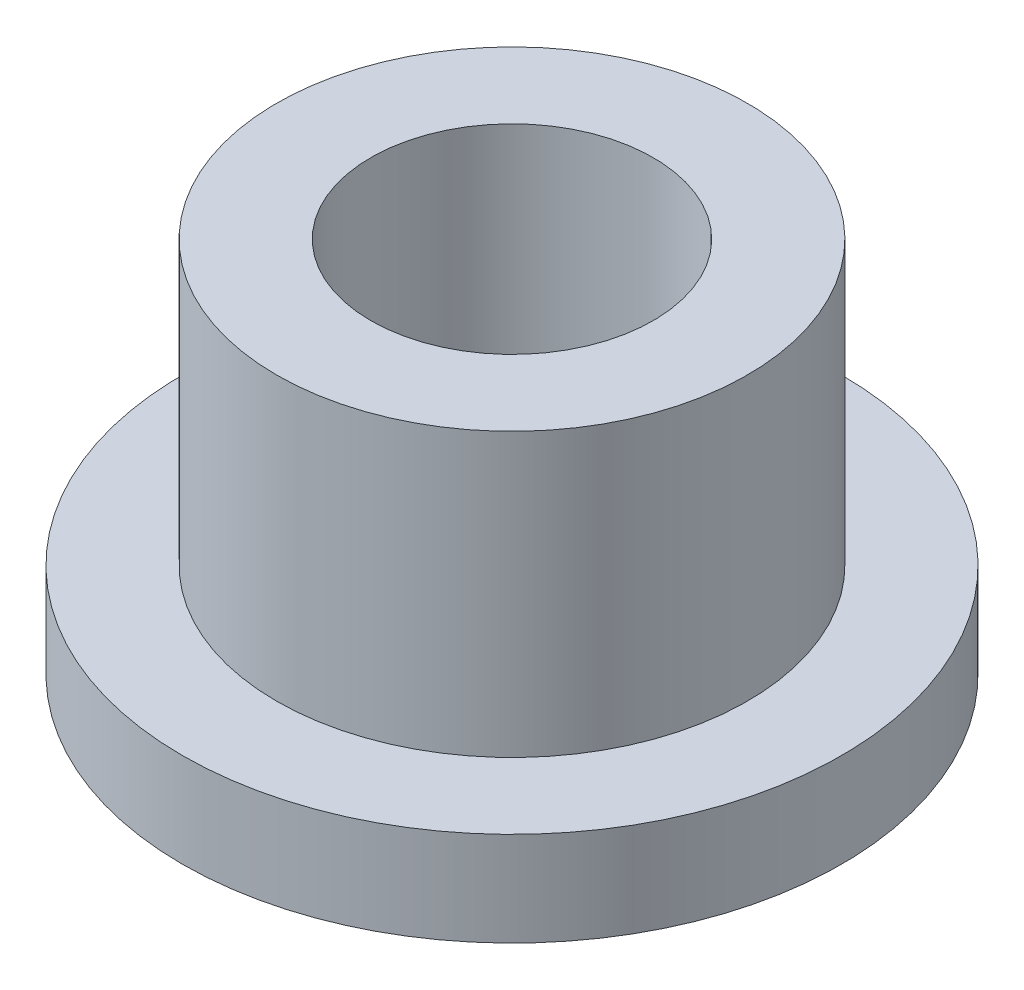
ISO-10303-21;
HEADER;
FILE_DESCRIPTION(('STEP AP214'),'2;1');
FILE_NAME('part.step','',(''),(''),'','','');
FILE_SCHEMA(('AUTOMOTIVE_DESIGN { 1 0 10303 214 1 1 1 1 }'));
ENDSEC;
DATA;
#1=APPLICATION_CONTEXT('core data for automotive mechanical design processes');
#2=APPLICATION_PROTOCOL_DEFINITION('international standard','automotive_design',2000,#1);
#3=PRODUCT_CONTEXT('',#1,'mechanical');
#4=PRODUCT('Part','Part','',(#3));
#5=PRODUCT_RELATED_PRODUCT_CATEGORY('part','',(#4));
#6=PRODUCT_DEFINITION_FORMATION('','',#4);
#7=PRODUCT_DEFINITION_CONTEXT('part definition',#1,'design');
#8=PRODUCT_DEFINITION('design','',#6,#7);
#9=PRODUCT_DEFINITION_SHAPE('','',#8);
#10=(LENGTH_UNIT() NAMED_UNIT(*) SI_UNIT(.MILLI.,.METRE.));
#11=(NAMED_UNIT(*) PLANE_ANGLE_UNIT() SI_UNIT($,.RADIAN.));
#12=(NAMED_UNIT(*) SI_UNIT($,.STERADIAN.) SOLID_ANGLE_UNIT());
#13=UNCERTAINTY_MEASURE_WITH_UNIT(LENGTH_MEASURE(1.E-05),#10,'distance_accuracy_value','');
#14=(GEOMETRIC_REPRESENTATION_CONTEXT(3) GLOBAL_UNCERTAINTY_ASSIGNED_CONTEXT((#13)) GLOBAL_UNIT_ASSIGNED_CONTEXT((#10,
#11,#12)) REPRESENTATION_CONTEXT('',''));
#15=CARTESIAN_POINT('',(0.,0.,0.));
#16=DIRECTION('',(0.,0.,1.));
#17=DIRECTION('',(1.,0.,0.));
#18=AXIS2_PLACEMENT_3D('',#15,#16,#17);
#19=CARTESIAN_POINT('',(0.,6.35,0.));
#20=DIRECTION('',(0.,1.,0.));
#21=DIRECTION('',(0.,0.,1.));
#22=AXIS2_PLACEMENT_3D('',#19,#20,#21);
#23=PLANE('',#22);
#24=CARTESIAN_POINT('',(0.,6.35,0.));
#25=DIRECTION('',(0.,1.,0.));
#26=DIRECTION('',(0.,0.,1.));
#27=AXIS2_PLACEMENT_3D('',#24,#25,#26);
#28=CIRCLE('',#27,3.96875);
#29=CARTESIAN_POINT('',(0.,6.35,3.96875));
#30=VERTEX_POINT('',#29);
#31=EDGE_CURVE('E10',#30,#30,#28,.T.);
#32=ORIENTED_EDGE('',*,*,#31,.T.);
#33=EDGE_LOOP('',(#32));
#34=FACE_BOUND('',#33,.T.);
#35=CARTESIAN_POINT('',(0.,6.35,0.));
#36=DIRECTION('',(0.,1.,0.));
#37=DIRECTION('',(0.,0.,1.));
#38=AXIS2_PLACEMENT_3D('',#35,#36,#37);
#39=CIRCLE('',#38,2.38125);
#40=CARTESIAN_POINT('',(0.,6.35,2.38125));
#41=VERTEX_POINT('',#40);
#42=EDGE_CURVE('E40',#41,#41,#39,.T.);
#43=ORIENTED_EDGE('',*,*,#42,.F.);
#44=EDGE_LOOP('',(#43));
#45=FACE_BOUND('',#44,.T.);
#46=ADVANCED_FACE('F33',(#34,#45),#23,.T.);
#47=CARTESIAN_POINT('',(0.,0.,0.));
#48=DIRECTION('',(0.,1.,0.));
#49=DIRECTION('',(0.,0.,1.));
#50=AXIS2_PLACEMENT_3D('',#47,#48,#49);
#51=PLANE('',#50);
#52=CARTESIAN_POINT('',(0.,0.,0.));
#53=DIRECTION('',(0.,1.,0.));
#54=DIRECTION('',(0.,0.,1.));
#55=AXIS2_PLACEMENT_3D('',#52,#53,#54);
#56=CIRCLE('',#55,2.38125);
#57=CARTESIAN_POINT('',(0.,0.,2.38125));
#58=VERTEX_POINT('',#57);
#59=EDGE_CURVE('E44',#58,#58,#56,.T.);
#60=ORIENTED_EDGE('',*,*,#59,.T.);
#61=EDGE_LOOP('',(#60));
#62=FACE_BOUND('',#61,.T.);
#63=CARTESIAN_POINT('',(0.,0.,0.));
#64=DIRECTION('',(0.,1.,0.));
#65=DIRECTION('',(0.,0.,1.));
#66=AXIS2_PLACEMENT_3D('',#63,#64,#65);
#67=CIRCLE('',#66,5.55625);
#68=CARTESIAN_POINT('',(0.,0.,5.55625));
#69=VERTEX_POINT('',#68);
#70=EDGE_CURVE('E51',#69,#69,#67,.T.);
#71=ORIENTED_EDGE('',*,*,#70,.F.);
#72=EDGE_LOOP('',(#71));
#73=FACE_BOUND('',#72,.T.);
#74=ADVANCED_FACE('F76',(#62,#73),#51,.F.);
#75=CARTESIAN_POINT('',(0.,6.35,0.));
#76=DIRECTION('',(0.,-1.,0.));
#77=DIRECTION('',(0.,0.,-1.));
#78=AXIS2_PLACEMENT_3D('',#75,#76,#77);
#79=CYLINDRICAL_SURFACE('',#78,3.96875);
#80=CARTESIAN_POINT('',(0.,1.5875,0.));
#81=DIRECTION('',(0.,1.,0.));
#82=DIRECTION('',(0.,0.,1.));
#83=AXIS2_PLACEMENT_3D('',#80,#81,#82);
#84=CIRCLE('',#83,3.96875);
#85=CARTESIAN_POINT('',(0.,1.5875,3.96875));
#86=VERTEX_POINT('',#85);
#87=EDGE_CURVE('E54',#86,#86,#84,.T.);
#88=ORIENTED_EDGE('',*,*,#87,.T.);
#89=EDGE_LOOP('',(#88));
#90=FACE_BOUND('',#89,.T.);
#91=ORIENTED_EDGE('',*,*,#31,.F.);
#92=EDGE_LOOP('',(#91));
#93=FACE_BOUND('',#92,.T.);
#94=ADVANCED_FACE('F35',(#90,#93),#79,.T.);
#95=CARTESIAN_POINT('',(0.,6.35,0.));
#96=DIRECTION('',(0.,-1.,0.));
#97=DIRECTION('',(0.,0.,-1.));
#98=AXIS2_PLACEMENT_3D('',#95,#96,#97);
#99=CYLINDRICAL_SURFACE('',#98,2.38125);
#100=ORIENTED_EDGE('',*,*,#42,.T.);
#101=EDGE_LOOP('',(#100));
#102=FACE_BOUND('',#101,.T.);
#103=ORIENTED_EDGE('',*,*,#59,.F.);
#104=EDGE_LOOP('',(#103));
#105=FACE_BOUND('',#104,.T.);
#106=ADVANCED_FACE('F65',(#102,#105),#99,.F.);
#107=CARTESIAN_POINT('',(0.,1.5875,0.));
#108=DIRECTION('',(0.,1.,0.));
#109=DIRECTION('',(0.,0.,1.));
#110=AXIS2_PLACEMENT_3D('',#107,#108,#109);
#111=PLANE('',#110);
#112=CARTESIAN_POINT('',(0.,1.5875,0.));
#113=DIRECTION('',(0.,1.,0.));
#114=DIRECTION('',(0.,0.,1.));
#115=AXIS2_PLACEMENT_3D('',#112,#113,#114);
#116=CIRCLE('',#115,5.55625);
#117=CARTESIAN_POINT('',(0.,1.5875,5.55625));
#118=VERTEX_POINT('',#117);
#119=EDGE_CURVE('E49',#118,#118,#116,.T.);
#120=ORIENTED_EDGE('',*,*,#119,.T.);
#121=EDGE_LOOP('',(#120));
#122=FACE_BOUND('',#121,.T.);
#123=ORIENTED_EDGE('',*,*,#87,.F.);
#124=EDGE_LOOP('',(#123));
#125=FACE_BOUND('',#124,.T.);
#126=ADVANCED_FACE('F62',(#122,#125),#111,.T.);
#127=CARTESIAN_POINT('',(0.,1.5875,0.));
#128=DIRECTION('',(0.,-1.,0.));
#129=DIRECTION('',(0.,0.,-1.));
#130=AXIS2_PLACEMENT_3D('',#127,#128,#129);
#131=CYLINDRICAL_SURFACE('',#130,5.55625);
#132=ORIENTED_EDGE('',*,*,#119,.F.);
#133=EDGE_LOOP('',(#132));
#134=FACE_BOUND('',#133,.T.);
#135=ORIENTED_EDGE('',*,*,#70,.T.);
#136=EDGE_LOOP('',(#135));
#137=FACE_BOUND('',#136,.T.);
#138=ADVANCED_FACE('F64',(#134,#137),#131,.T.);
#139=CLOSED_SHELL('',(#46,#74,#94,#106,#126,#138));
#140=MANIFOLD_SOLID_BREP('B2',#139);
#141=ADVANCED_BREP_SHAPE_REPRESENTATION('',(#18,#140),#14);
#142=SHAPE_DEFINITION_REPRESENTATION(#9,#141);
ENDSEC;
END-ISO-10303-21;
